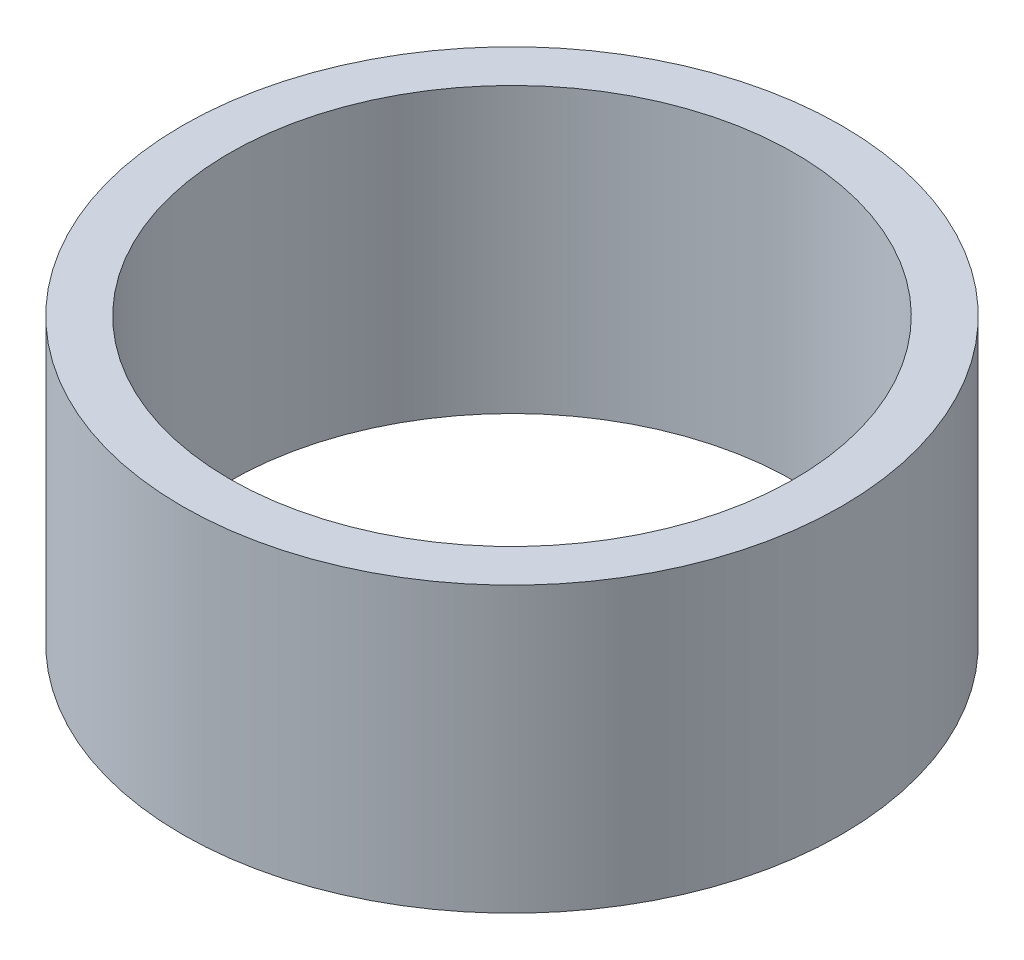
ISO-10303-21;
HEADER;
FILE_DESCRIPTION(('STEP AP214'),'2;1');
FILE_NAME('part.step','',(''),(''),'','','');
FILE_SCHEMA(('AUTOMOTIVE_DESIGN { 1 0 10303 214 1 1 1 1 }'));
ENDSEC;
DATA;
#1=APPLICATION_CONTEXT('core data for automotive mechanical design processes');
#2=APPLICATION_PROTOCOL_DEFINITION('international standard','automotive_design',2000,#1);
#3=PRODUCT_CONTEXT('',#1,'mechanical');
#4=PRODUCT('Part','Part','',(#3));
#5=PRODUCT_RELATED_PRODUCT_CATEGORY('part','',(#4));
#6=PRODUCT_DEFINITION_FORMATION('','',#4);
#7=PRODUCT_DEFINITION_CONTEXT('part definition',#1,'design');
#8=PRODUCT_DEFINITION('design','',#6,#7);
#9=PRODUCT_DEFINITION_SHAPE('','',#8);
#10=(LENGTH_UNIT() NAMED_UNIT(*) SI_UNIT(.MILLI.,.METRE.));
#11=(NAMED_UNIT(*) PLANE_ANGLE_UNIT() SI_UNIT($,.RADIAN.));
#12=(NAMED_UNIT(*) SI_UNIT($,.STERADIAN.) SOLID_ANGLE_UNIT());
#13=UNCERTAINTY_MEASURE_WITH_UNIT(LENGTH_MEASURE(1.E-05),#10,'distance_accuracy_value','');
#14=(GEOMETRIC_REPRESENTATION_CONTEXT(3) GLOBAL_UNCERTAINTY_ASSIGNED_CONTEXT((#13)) GLOBAL_UNIT_ASSIGNED_CONTEXT((#10,
#11,#12)) REPRESENTATION_CONTEXT('',''));
#15=CARTESIAN_POINT('',(0.,0.,0.));
#16=DIRECTION('',(0.,0.,1.));
#17=DIRECTION('',(1.,0.,0.));
#18=AXIS2_PLACEMENT_3D('',#15,#16,#17);
#19=CARTESIAN_POINT('',(0.,12.,0.));
#20=DIRECTION('',(0.,1.,0.));
#21=DIRECTION('',(0.,0.,1.));
#22=AXIS2_PLACEMENT_3D('',#19,#20,#21);
#23=PLANE('',#22);
#24=CARTESIAN_POINT('',(0.,12.,0.));
#25=DIRECTION('',(0.,1.,0.));
#26=DIRECTION('',(0.,0.,1.));
#27=AXIS2_PLACEMENT_3D('',#24,#25,#26);
#28=CIRCLE('',#27,13.925);
#29=CARTESIAN_POINT('',(0.,12.,13.925));
#30=VERTEX_POINT('',#29);
#31=EDGE_CURVE('E10',#30,#30,#28,.T.);
#32=ORIENTED_EDGE('',*,*,#31,.T.);
#33=EDGE_LOOP('',(#32));
#34=FACE_BOUND('',#33,.T.);
#35=CARTESIAN_POINT('',(0.,12.,0.));
#36=DIRECTION('',(0.,1.,0.));
#37=DIRECTION('',(0.,0.,1.));
#38=AXIS2_PLACEMENT_3D('',#35,#36,#37);
#39=CIRCLE('',#38,11.925);
#40=CARTESIAN_POINT('',(0.,12.,11.925));
#41=VERTEX_POINT('',#40);
#42=EDGE_CURVE('E42',#41,#41,#39,.T.);
#43=ORIENTED_EDGE('',*,*,#42,.F.);
#44=EDGE_LOOP('',(#43));
#45=FACE_BOUND('',#44,.T.);
#46=ADVANCED_FACE('F31',(#34,#45),#23,.T.);
#47=CARTESIAN_POINT('',(0.,0.,0.));
#48=DIRECTION('',(0.,1.,0.));
#49=DIRECTION('',(0.,0.,1.));
#50=AXIS2_PLACEMENT_3D('',#47,#48,#49);
#51=PLANE('',#50);
#52=CARTESIAN_POINT('',(0.,0.,0.));
#53=DIRECTION('',(0.,1.,0.));
#54=DIRECTION('',(0.,0.,1.));
#55=AXIS2_PLACEMENT_3D('',#52,#53,#54);
#56=CIRCLE('',#55,13.925);
#57=CARTESIAN_POINT('',(0.,0.,13.925));
#58=VERTEX_POINT('',#57);
#59=EDGE_CURVE('E35',#58,#58,#56,.T.);
#60=ORIENTED_EDGE('',*,*,#59,.F.);
#61=EDGE_LOOP('',(#60));
#62=FACE_BOUND('',#61,.T.);
#63=CARTESIAN_POINT('',(0.,0.,0.));
#64=DIRECTION('',(0.,1.,0.));
#65=DIRECTION('',(0.,0.,1.));
#66=AXIS2_PLACEMENT_3D('',#63,#64,#65);
#67=CIRCLE('',#66,11.925);
#68=CARTESIAN_POINT('',(0.,0.,11.925));
#69=VERTEX_POINT('',#68);
#70=EDGE_CURVE('E44',#69,#69,#67,.T.);
#71=ORIENTED_EDGE('',*,*,#70,.T.);
#72=EDGE_LOOP('',(#71));
#73=FACE_BOUND('',#72,.T.);
#74=ADVANCED_FACE('F54',(#62,#73),#51,.F.);
#75=CARTESIAN_POINT('',(0.,12.,0.));
#76=DIRECTION('',(0.,-1.,0.));
#77=DIRECTION('',(0.,0.,-1.));
#78=AXIS2_PLACEMENT_3D('',#75,#76,#77);
#79=CYLINDRICAL_SURFACE('',#78,13.925);
#80=ORIENTED_EDGE('',*,*,#31,.F.);
#81=EDGE_LOOP('',(#80));
#82=FACE_BOUND('',#81,.T.);
#83=ORIENTED_EDGE('',*,*,#59,.T.);
#84=EDGE_LOOP('',(#83));
#85=FACE_BOUND('',#84,.T.);
#86=ADVANCED_FACE('F33',(#82,#85),#79,.T.);
#87=CARTESIAN_POINT('',(0.,12.,0.));
#88=DIRECTION('',(0.,-1.,0.));
#89=DIRECTION('',(0.,0.,-1.));
#90=AXIS2_PLACEMENT_3D('',#87,#88,#89);
#91=CYLINDRICAL_SURFACE('',#90,11.925);
#92=ORIENTED_EDGE('',*,*,#42,.T.);
#93=EDGE_LOOP('',(#92));
#94=FACE_BOUND('',#93,.T.);
#95=ORIENTED_EDGE('',*,*,#70,.F.);
#96=EDGE_LOOP('',(#95));
#97=FACE_BOUND('',#96,.T.);
#98=ADVANCED_FACE('F50',(#94,#97),#91,.F.);
#99=CLOSED_SHELL('',(#46,#74,#86,#98));
#100=MANIFOLD_SOLID_BREP('B2',#99);
#101=ADVANCED_BREP_SHAPE_REPRESENTATION('',(#18,#100),#14);
#102=SHAPE_DEFINITION_REPRESENTATION(#9,#101);
ENDSEC;
END-ISO-10303-21;
